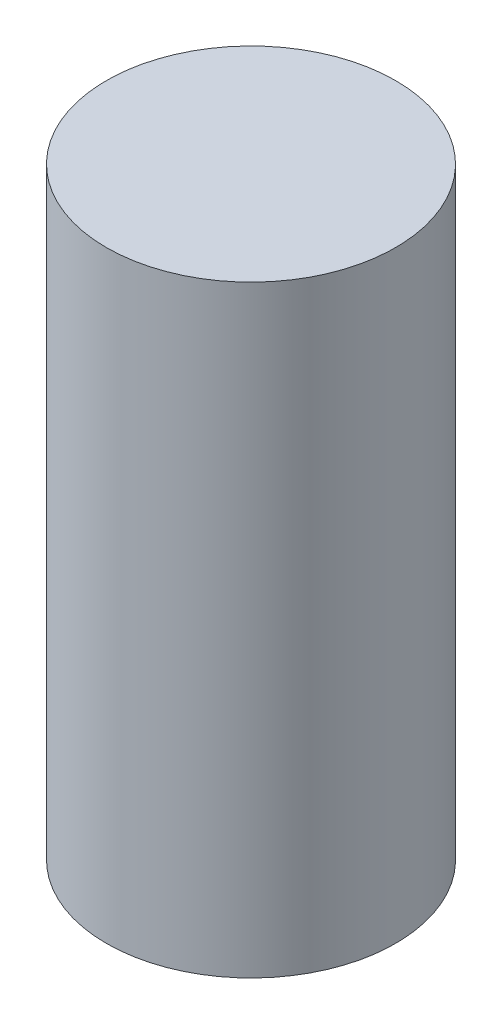
ISO-10303-21;
HEADER;
FILE_DESCRIPTION(('STEP AP214'),'2;1');
FILE_NAME('part.step','',(''),(''),'','','');
FILE_SCHEMA(('AUTOMOTIVE_DESIGN { 1 0 10303 214 1 1 1 1 }'));
ENDSEC;
DATA;
#1=APPLICATION_CONTEXT('core data for automotive mechanical design processes');
#2=APPLICATION_PROTOCOL_DEFINITION('international standard','automotive_design',2000,#1);
#3=PRODUCT_CONTEXT('',#1,'mechanical');
#4=PRODUCT('Part','Part','',(#3));
#5=PRODUCT_RELATED_PRODUCT_CATEGORY('part','',(#4));
#6=PRODUCT_DEFINITION_FORMATION('','',#4);
#7=PRODUCT_DEFINITION_CONTEXT('part definition',#1,'design');
#8=PRODUCT_DEFINITION('design','',#6,#7);
#9=PRODUCT_DEFINITION_SHAPE('','',#8);
#10=(LENGTH_UNIT() NAMED_UNIT(*) SI_UNIT(.MILLI.,.METRE.));
#11=(NAMED_UNIT(*) PLANE_ANGLE_UNIT() SI_UNIT($,.RADIAN.));
#12=(NAMED_UNIT(*) SI_UNIT($,.STERADIAN.) SOLID_ANGLE_UNIT());
#13=UNCERTAINTY_MEASURE_WITH_UNIT(LENGTH_MEASURE(1.E-05),#10,'distance_accuracy_value','');
#14=(GEOMETRIC_REPRESENTATION_CONTEXT(3) GLOBAL_UNCERTAINTY_ASSIGNED_CONTEXT((#13)) GLOBAL_UNIT_ASSIGNED_CONTEXT((#10,
#11,#12)) REPRESENTATION_CONTEXT('',''));
#15=CARTESIAN_POINT('',(0.,0.,0.));
#16=DIRECTION('',(0.,0.,1.));
#17=DIRECTION('',(1.,0.,0.));
#18=AXIS2_PLACEMENT_3D('',#15,#16,#17);
#19=CARTESIAN_POINT('',(0.,8.,0.));
#20=DIRECTION('',(0.,-1.,0.));
#21=DIRECTION('',(0.,0.,-1.));
#22=AXIS2_PLACEMENT_3D('',#19,#20,#21);
#23=CYLINDRICAL_SURFACE('',#22,1.92);
#24=CARTESIAN_POINT('',(0.,8.,0.));
#25=DIRECTION('',(0.,1.,0.));
#26=DIRECTION('',(0.,0.,1.));
#27=AXIS2_PLACEMENT_3D('',#24,#25,#26);
#28=CIRCLE('',#27,1.92);
#29=CARTESIAN_POINT('',(0.,8.,1.92));
#30=VERTEX_POINT('',#29);
#31=EDGE_CURVE('E10',#30,#30,#28,.T.);
#32=ORIENTED_EDGE('',*,*,#31,.F.);
#33=EDGE_LOOP('',(#32));
#34=FACE_BOUND('',#33,.T.);
#35=CARTESIAN_POINT('',(0.,0.,0.));
#36=DIRECTION('',(0.,1.,0.));
#37=DIRECTION('',(0.,0.,1.));
#38=AXIS2_PLACEMENT_3D('',#35,#36,#37);
#39=CIRCLE('',#38,1.92);
#40=CARTESIAN_POINT('',(0.,0.,1.92));
#41=VERTEX_POINT('',#40);
#42=EDGE_CURVE('E40',#41,#41,#39,.T.);
#43=ORIENTED_EDGE('',*,*,#42,.T.);
#44=EDGE_LOOP('',(#43));
#45=FACE_BOUND('',#44,.T.);
#46=ADVANCED_FACE('F37',(#34,#45),#23,.T.);
#47=CARTESIAN_POINT('',(0.,8.,0.));
#48=DIRECTION('',(0.,1.,0.));
#49=DIRECTION('',(0.,0.,1.));
#50=AXIS2_PLACEMENT_3D('',#47,#48,#49);
#51=PLANE('',#50);
#52=ORIENTED_EDGE('',*,*,#31,.T.);
#53=EDGE_LOOP('',(#52));
#54=FACE_BOUND('',#53,.T.);
#55=ADVANCED_FACE('F52',(#54),#51,.T.);
#56=CARTESIAN_POINT('',(0.,0.,0.));
#57=DIRECTION('',(0.,1.,0.));
#58=DIRECTION('',(0.,0.,1.));
#59=AXIS2_PLACEMENT_3D('',#56,#57,#58);
#60=PLANE('',#59);
#61=ORIENTED_EDGE('',*,*,#42,.F.);
#62=EDGE_LOOP('',(#61));
#63=FACE_BOUND('',#62,.T.);
#64=ADVANCED_FACE('F50',(#63),#60,.F.);
#65=CLOSED_SHELL('',(#46,#55,#64));
#66=MANIFOLD_SOLID_BREP('B2',#65);
#67=ADVANCED_BREP_SHAPE_REPRESENTATION('',(#18,#66),#14);
#68=SHAPE_DEFINITION_REPRESENTATION(#9,#67);
ENDSEC;
END-ISO-10303-21;
